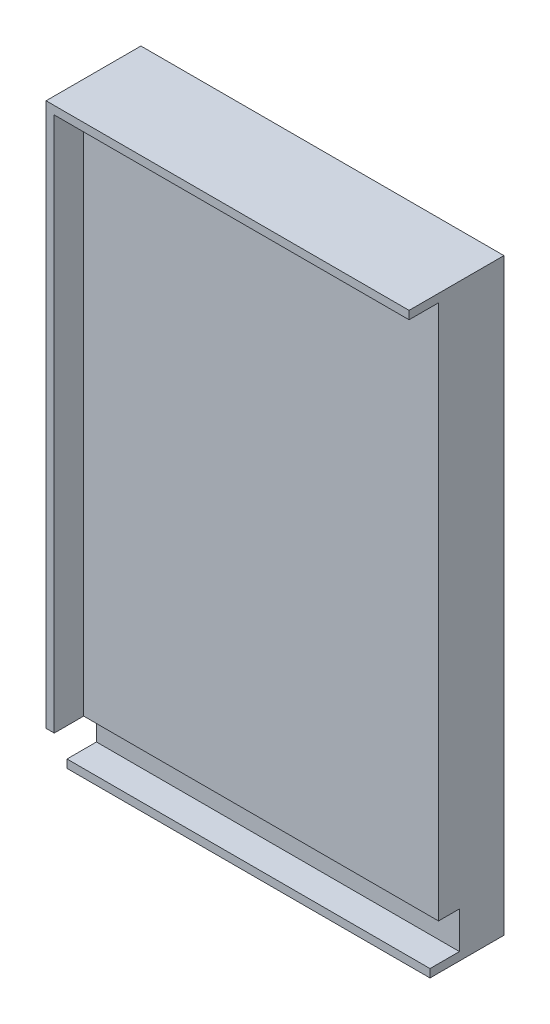
ISO-10303-21;
HEADER;
FILE_DESCRIPTION(('STEP AP214'),'2;1');
FILE_NAME('part.step','',(''),(''),'','','');
FILE_SCHEMA(('AUTOMOTIVE_DESIGN { 1 0 10303 214 1 1 1 1 }'));
ENDSEC;
DATA;
#1=APPLICATION_CONTEXT('core data for automotive mechanical design processes');
#2=APPLICATION_PROTOCOL_DEFINITION('international standard','automotive_design',2000,#1);
#3=PRODUCT_CONTEXT('',#1,'mechanical');
#4=PRODUCT('Part','Part','',(#3));
#5=PRODUCT_RELATED_PRODUCT_CATEGORY('part','',(#4));
#6=PRODUCT_DEFINITION_FORMATION('','',#4);
#7=PRODUCT_DEFINITION_CONTEXT('part definition',#1,'design');
#8=PRODUCT_DEFINITION('design','',#6,#7);
#9=PRODUCT_DEFINITION_SHAPE('','',#8);
#10=(LENGTH_UNIT() NAMED_UNIT(*) SI_UNIT(.MILLI.,.METRE.));
#11=(NAMED_UNIT(*) PLANE_ANGLE_UNIT() SI_UNIT($,.RADIAN.));
#12=(NAMED_UNIT(*) SI_UNIT($,.STERADIAN.) SOLID_ANGLE_UNIT());
#13=UNCERTAINTY_MEASURE_WITH_UNIT(LENGTH_MEASURE(1.E-05),#10,'distance_accuracy_value','');
#14=(GEOMETRIC_REPRESENTATION_CONTEXT(3) GLOBAL_UNCERTAINTY_ASSIGNED_CONTEXT((#13)) GLOBAL_UNIT_ASSIGNED_CONTEXT((#10,
#11,#12)) REPRESENTATION_CONTEXT('',''));
#15=CARTESIAN_POINT('',(0.,0.,0.));
#16=DIRECTION('',(0.,0.,1.));
#17=DIRECTION('',(1.,0.,0.));
#18=AXIS2_PLACEMENT_3D('',#15,#16,#17);
#19=CARTESIAN_POINT('',(72.6068292682926,-97.9603658536585,36.84));
#20=DIRECTION('',(-1.,0.,0.));
#21=DIRECTION('',(0.,-1.,0.));
#22=AXIS2_PLACEMENT_3D('',#19,#20,#21);
#23=PLANE('',#22);
#24=DIRECTION('',(0.,-1.,0.));
#25=VECTOR('',#24,1.);
#26=CARTESIAN_POINT('',(72.6068292682926,-94.7853658536585,28.702));
#27=LINE('',#26,#25);
#28=CARTESIAN_POINT('',(72.6068292682926,-94.7853658536585,28.702));
#29=VERTEX_POINT('',#28);
#30=CARTESIAN_POINT('',(72.6068292682926,-97.9603658536585,28.702));
#31=VERTEX_POINT('',#30);
#32=EDGE_CURVE('E42',#29,#31,#27,.T.);
#33=ORIENTED_EDGE('',*,*,#32,.T.);
#34=DIRECTION('',(0.,0.,1.));
#35=VECTOR('',#34,1.);
#36=CARTESIAN_POINT('',(72.6068292682926,-97.9603658536585,0.));
#37=LINE('',#36,#35);
#38=CARTESIAN_POINT('',(72.6068292682926,-97.9603658536585,0.));
#39=VERTEX_POINT('',#38);
#40=EDGE_CURVE('E201',#39,#31,#37,.T.);
#41=ORIENTED_EDGE('',*,*,#40,.F.);
#42=DIRECTION('',(0.,-1.,0.));
#43=VECTOR('',#42,1.);
#44=CARTESIAN_POINT('',(72.6068292682926,0.,0.));
#45=LINE('',#44,#43);
#46=CARTESIAN_POINT('',(72.6068292682926,130.639634146342,0.));
#47=VERTEX_POINT('',#46);
#48=EDGE_CURVE('E196',#47,#39,#45,.T.);
#49=ORIENTED_EDGE('',*,*,#48,.F.);
#50=DIRECTION('',(0.,0.,-1.));
#51=VECTOR('',#50,1.);
#52=CARTESIAN_POINT('',(72.6068292682926,130.639634146342,25.4));
#53=LINE('',#52,#51);
#54=CARTESIAN_POINT('',(72.6068292682926,130.639634146342,36.83));
#55=VERTEX_POINT('',#54);
#56=EDGE_CURVE('E198',#55,#47,#53,.T.);
#57=ORIENTED_EDGE('',*,*,#56,.F.);
#58=DIRECTION('',(0.,-1.,0.));
#59=VECTOR('',#58,1.);
#60=CARTESIAN_POINT('',(72.6068292682926,127.464634146342,36.83));
#61=LINE('',#60,#59);
#62=CARTESIAN_POINT('',(72.6068292682926,127.464634146342,36.83));
#63=VERTEX_POINT('',#62);
#64=EDGE_CURVE('E47',#55,#63,#61,.T.);
#65=ORIENTED_EDGE('',*,*,#64,.T.);
#66=DIRECTION('',(0.,0.,-1.));
#67=VECTOR('',#66,1.);
#68=CARTESIAN_POINT('',(72.6068292682926,127.464634146342,0.));
#69=LINE('',#68,#67);
#70=CARTESIAN_POINT('',(72.6068292682926,127.464634146342,25.4));
#71=VERTEX_POINT('',#70);
#72=EDGE_CURVE('E11',#63,#71,#69,.T.);
#73=ORIENTED_EDGE('',*,*,#72,.T.);
#74=DIRECTION('',(0.,-1.,0.));
#75=VECTOR('',#74,1.);
#76=CARTESIAN_POINT('',(72.6068292682926,0.,25.4));
#77=LINE('',#76,#75);
#78=CARTESIAN_POINT('',(72.6068292682926,-80.4343658536585,25.4));
#79=VERTEX_POINT('',#78);
#80=EDGE_CURVE('E61',#71,#79,#77,.T.);
#81=ORIENTED_EDGE('',*,*,#80,.T.);
#82=DIRECTION('',(0.,0.,1.));
#83=VECTOR('',#82,1.);
#84=CARTESIAN_POINT('',(72.6068292682926,-80.4343658536585,17.272));
#85=LINE('',#84,#83);
#86=CARTESIAN_POINT('',(72.6068292682926,-80.4343658536585,17.272));
#87=VERTEX_POINT('',#86);
#88=EDGE_CURVE('E194',#87,#79,#85,.T.);
#89=ORIENTED_EDGE('',*,*,#88,.F.);
#90=DIRECTION('',(0.,1.,0.));
#91=VECTOR('',#90,1.);
#92=CARTESIAN_POINT('',(72.6068292682926,0.,17.272));
#93=LINE('',#92,#91);
#94=CARTESIAN_POINT('',(72.6068292682926,-94.7853658536585,17.272));
#95=VERTEX_POINT('',#94);
#96=EDGE_CURVE('E200',#95,#87,#93,.T.);
#97=ORIENTED_EDGE('',*,*,#96,.F.);
#98=DIRECTION('',(0.,0.,1.));
#99=VECTOR('',#98,1.);
#100=CARTESIAN_POINT('',(72.6068292682926,-94.7853658536585,0.));
#101=LINE('',#100,#99);
#102=EDGE_CURVE('E205',#95,#29,#101,.T.);
#103=ORIENTED_EDGE('',*,*,#102,.T.);
#104=EDGE_LOOP('',(#33,#41,#49,#57,#65,#73,#81,#89,#97,#103));
#105=FACE_BOUND('',#104,.T.);
#106=ADVANCED_FACE('F39',(#105),#23,.F.);
#107=CARTESIAN_POINT('',(-68.3631707317073,-94.7853658536585,17.272));
#108=DIRECTION('',(-1.,0.,0.));
#109=DIRECTION('',(0.,0.,1.));
#110=AXIS2_PLACEMENT_3D('',#107,#108,#109);
#111=PLANE('',#110);
#112=DIRECTION('',(0.,0.,-1.));
#113=VECTOR('',#112,1.);
#114=CARTESIAN_POINT('',(-68.3631707317073,-97.9603658536585,17.272));
#115=LINE('',#114,#113);
#116=CARTESIAN_POINT('',(-68.3631707317073,-97.9603658536585,28.702));
#117=VERTEX_POINT('',#116);
#118=CARTESIAN_POINT('',(-68.3631707317073,-97.9603658536585,0.));
#119=VERTEX_POINT('',#118);
#120=EDGE_CURVE('E185',#117,#119,#115,.T.);
#121=ORIENTED_EDGE('',*,*,#120,.F.);
#122=DIRECTION('',(0.,-1.,0.));
#123=VECTOR('',#122,1.);
#124=CARTESIAN_POINT('',(-68.3631707317073,-94.7853658536585,28.702));
#125=LINE('',#124,#123);
#126=CARTESIAN_POINT('',(-68.3631707317073,-94.7853658536585,28.702));
#127=VERTEX_POINT('',#126);
#128=EDGE_CURVE('E190',#127,#117,#125,.T.);
#129=ORIENTED_EDGE('',*,*,#128,.F.);
#130=DIRECTION('',(0.,0.,-1.));
#131=VECTOR('',#130,1.);
#132=CARTESIAN_POINT('',(-68.3631707317073,-94.7853658536585,17.272));
#133=LINE('',#132,#131);
#134=CARTESIAN_POINT('',(-68.3631707317073,-94.7853658536585,17.272));
#135=VERTEX_POINT('',#134);
#136=EDGE_CURVE('E187',#127,#135,#133,.T.);
#137=ORIENTED_EDGE('',*,*,#136,.T.);
#138=DIRECTION('',(0.,-1.,0.));
#139=VECTOR('',#138,1.);
#140=CARTESIAN_POINT('',(-68.3631707317073,-97.9603658536585,17.272));
#141=LINE('',#140,#139);
#142=CARTESIAN_POINT('',(-68.3631707317074,-80.4343658536585,17.272));
#143=VERTEX_POINT('',#142);
#144=EDGE_CURVE('E163',#143,#135,#141,.T.);
#145=ORIENTED_EDGE('',*,*,#144,.F.);
#146=DIRECTION('',(0.,0.,1.));
#147=VECTOR('',#146,1.);
#148=CARTESIAN_POINT('',(-68.3631707317074,-80.4343658536585,17.272));
#149=LINE('',#148,#147);
#150=CARTESIAN_POINT('',(-68.3631707317073,-80.4343658536585,36.83));
#151=VERTEX_POINT('',#150);
#152=EDGE_CURVE('E166',#143,#151,#149,.T.);
#153=ORIENTED_EDGE('',*,*,#152,.T.);
#154=DIRECTION('',(0.,1.,0.));
#155=VECTOR('',#154,1.);
#156=CARTESIAN_POINT('',(-68.3631707317074,130.639634146342,36.83));
#157=LINE('',#156,#155);
#158=CARTESIAN_POINT('',(-68.3631707317074,130.639634146342,36.83));
#159=VERTEX_POINT('',#158);
#160=EDGE_CURVE('E130',#151,#159,#157,.T.);
#161=ORIENTED_EDGE('',*,*,#160,.T.);
#162=DIRECTION('',(0.,0.,-1.));
#163=VECTOR('',#162,1.);
#164=CARTESIAN_POINT('',(-68.3631707317074,130.639634146342,25.4));
#165=LINE('',#164,#163);
#166=CARTESIAN_POINT('',(-68.3631707317074,130.639634146342,0.));
#167=VERTEX_POINT('',#166);
#168=EDGE_CURVE('E177',#159,#167,#165,.T.);
#169=ORIENTED_EDGE('',*,*,#168,.T.);
#170=DIRECTION('',(0.,-1.,0.));
#171=VECTOR('',#170,1.);
#172=CARTESIAN_POINT('',(-68.3631707317074,130.639634146342,0.));
#173=LINE('',#172,#171);
#174=EDGE_CURVE('E169',#167,#119,#173,.T.);
#175=ORIENTED_EDGE('',*,*,#174,.T.);
#176=EDGE_LOOP('',(#121,#129,#137,#145,#153,#161,#169,#175));
#177=FACE_BOUND('',#176,.T.);
#178=ADVANCED_FACE('F227',(#177),#111,.T.);
#179=CARTESIAN_POINT('',(-68.3631707317073,-94.7853658536585,28.702));
#180=DIRECTION('',(0.,0.,1.));
#181=DIRECTION('',(1.,0.,0.));
#182=AXIS2_PLACEMENT_3D('',#179,#180,#181);
#183=PLANE('',#182);
#184=ORIENTED_EDGE('',*,*,#32,.F.);
#185=DIRECTION('',(-1.,0.,0.));
#186=VECTOR('',#185,1.);
#187=CARTESIAN_POINT('',(-68.3631707317073,-94.7853658536585,28.702));
#188=LINE('',#187,#186);
#189=EDGE_CURVE('E184',#29,#127,#188,.T.);
#190=ORIENTED_EDGE('',*,*,#189,.T.);
#191=ORIENTED_EDGE('',*,*,#128,.T.);
#192=DIRECTION('',(-1.,0.,0.));
#193=VECTOR('',#192,1.);
#194=CARTESIAN_POINT('',(-68.3631707317073,-97.9603658536585,28.702));
#195=LINE('',#194,#193);
#196=EDGE_CURVE('E180',#31,#117,#195,.T.);
#197=ORIENTED_EDGE('',*,*,#196,.F.);
#198=EDGE_LOOP('',(#184,#190,#191,#197));
#199=FACE_BOUND('',#198,.T.);
#200=ADVANCED_FACE('F216',(#199),#183,.T.);
#201=CARTESIAN_POINT('',(0.,-94.7853658536585,0.));
#202=DIRECTION('',(0.,1.,0.));
#203=DIRECTION('',(0.,0.,1.));
#204=AXIS2_PLACEMENT_3D('',#201,#202,#203);
#205=PLANE('',#204);
#206=ORIENTED_EDGE('',*,*,#102,.F.);
#207=DIRECTION('',(1.,0.,0.));
#208=VECTOR('',#207,1.);
#209=CARTESIAN_POINT('',(213.576829268293,-94.7853658536585,17.272));
#210=LINE('',#209,#208);
#211=EDGE_CURVE('E181',#135,#95,#210,.T.);
#212=ORIENTED_EDGE('',*,*,#211,.F.);
#213=ORIENTED_EDGE('',*,*,#136,.F.);
#214=ORIENTED_EDGE('',*,*,#189,.F.);
#215=EDGE_LOOP('',(#206,#212,#213,#214));
#216=FACE_BOUND('',#215,.T.);
#217=ADVANCED_FACE('F266',(#216),#205,.T.);
#218=CARTESIAN_POINT('',(0.,-97.9603658536585,0.));
#219=DIRECTION('',(0.,1.,0.));
#220=DIRECTION('',(0.,0.,1.));
#221=AXIS2_PLACEMENT_3D('',#218,#219,#220);
#222=PLANE('',#221);
#223=DIRECTION('',(1.,0.,0.));
#224=VECTOR('',#223,1.);
#225=CARTESIAN_POINT('',(-68.3631707317073,-97.9603658536585,0.));
#226=LINE('',#225,#224);
#227=EDGE_CURVE('E172',#119,#39,#226,.T.);
#228=ORIENTED_EDGE('',*,*,#227,.T.);
#229=ORIENTED_EDGE('',*,*,#40,.T.);
#230=ORIENTED_EDGE('',*,*,#196,.T.);
#231=ORIENTED_EDGE('',*,*,#120,.T.);
#232=EDGE_LOOP('',(#228,#229,#230,#231));
#233=FACE_BOUND('',#232,.T.);
#234=ADVANCED_FACE('F220',(#233),#222,.F.);
#235=CARTESIAN_POINT('',(0.,0.,17.272));
#236=DIRECTION('',(0.,0.,-1.));
#237=DIRECTION('',(-1.,0.,0.));
#238=AXIS2_PLACEMENT_3D('',#235,#236,#237);
#239=PLANE('',#238);
#240=ORIENTED_EDGE('',*,*,#211,.T.);
#241=ORIENTED_EDGE('',*,*,#96,.T.);
#242=DIRECTION('',(-1.,0.,0.));
#243=VECTOR('',#242,1.);
#244=CARTESIAN_POINT('',(-68.3631707317074,-80.4343658536585,17.272));
#245=LINE('',#244,#243);
#246=EDGE_CURVE('E161',#87,#143,#245,.T.);
#247=ORIENTED_EDGE('',*,*,#246,.T.);
#248=ORIENTED_EDGE('',*,*,#144,.T.);
#249=EDGE_LOOP('',(#240,#241,#247,#248));
#250=FACE_BOUND('',#249,.T.);
#251=ADVANCED_FACE('F235',(#250),#239,.F.);
#252=CARTESIAN_POINT('',(0.,0.,25.4));
#253=DIRECTION('',(0.,0.,1.));
#254=DIRECTION('',(1.,0.,0.));
#255=AXIS2_PLACEMENT_3D('',#252,#253,#254);
#256=PLANE('',#255);
#257=ORIENTED_EDGE('',*,*,#80,.F.);
#258=DIRECTION('',(-1.,0.,0.));
#259=VECTOR('',#258,1.);
#260=CARTESIAN_POINT('',(-65.1881707317074,127.464634146342,25.4));
#261=LINE('',#260,#259);
#262=CARTESIAN_POINT('',(-65.1881707317074,127.464634146342,25.4));
#263=VERTEX_POINT('',#262);
#264=EDGE_CURVE('E154',#71,#263,#261,.T.);
#265=ORIENTED_EDGE('',*,*,#264,.T.);
#266=DIRECTION('',(0.,-1.,0.));
#267=VECTOR('',#266,1.);
#268=CARTESIAN_POINT('',(-65.1881707317073,-80.4343658536585,25.4));
#269=LINE('',#268,#267);
#270=CARTESIAN_POINT('',(-65.1881707317073,-80.4343658536585,25.4));
#271=VERTEX_POINT('',#270);
#272=EDGE_CURVE('E149',#263,#271,#269,.T.);
#273=ORIENTED_EDGE('',*,*,#272,.T.);
#274=DIRECTION('',(-1.,0.,0.));
#275=VECTOR('',#274,1.);
#276=CARTESIAN_POINT('',(-68.3631707317074,-80.4343658536585,25.4));
#277=LINE('',#276,#275);
#278=EDGE_CURVE('E147',#79,#271,#277,.T.);
#279=ORIENTED_EDGE('',*,*,#278,.F.);
#280=EDGE_LOOP('',(#257,#265,#273,#279));
#281=FACE_BOUND('',#280,.T.);
#282=ADVANCED_FACE('F233',(#281),#256,.T.);
#283=CARTESIAN_POINT('',(-68.3631707317074,130.639634146342,25.4));
#284=DIRECTION('',(0.,-1.,0.));
#285=DIRECTION('',(1.,0.,0.));
#286=AXIS2_PLACEMENT_3D('',#283,#284,#285);
#287=PLANE('',#286);
#288=DIRECTION('',(1.,0.,0.));
#289=VECTOR('',#288,1.);
#290=CARTESIAN_POINT('',(213.576829268293,130.639634146342,36.83));
#291=LINE('',#290,#289);
#292=EDGE_CURVE('E134',#159,#55,#291,.T.);
#293=ORIENTED_EDGE('',*,*,#292,.T.);
#294=ORIENTED_EDGE('',*,*,#56,.T.);
#295=DIRECTION('',(-1.,0.,0.));
#296=VECTOR('',#295,1.);
#297=CARTESIAN_POINT('',(-68.3631707317074,130.639634146342,0.));
#298=LINE('',#297,#296);
#299=EDGE_CURVE('E175',#47,#167,#298,.T.);
#300=ORIENTED_EDGE('',*,*,#299,.T.);
#301=ORIENTED_EDGE('',*,*,#168,.F.);
#302=EDGE_LOOP('',(#293,#294,#300,#301));
#303=FACE_BOUND('',#302,.T.);
#304=ADVANCED_FACE('F229',(#303),#287,.F.);
#305=CARTESIAN_POINT('',(0.,0.,0.));
#306=DIRECTION('',(0.,0.,1.));
#307=DIRECTION('',(1.,0.,0.));
#308=AXIS2_PLACEMENT_3D('',#305,#306,#307);
#309=PLANE('',#308);
#310=ORIENTED_EDGE('',*,*,#299,.F.);
#311=ORIENTED_EDGE('',*,*,#48,.T.);
#312=ORIENTED_EDGE('',*,*,#227,.F.);
#313=ORIENTED_EDGE('',*,*,#174,.F.);
#314=EDGE_LOOP('',(#310,#311,#312,#313));
#315=FACE_BOUND('',#314,.T.);
#316=ADVANCED_FACE('F225',(#315),#309,.F.);
#317=CARTESIAN_POINT('',(-68.3631707317074,-80.4343658536585,17.272));
#318=DIRECTION('',(0.,1.,0.));
#319=DIRECTION('',(0.,0.,1.));
#320=AXIS2_PLACEMENT_3D('',#317,#318,#319);
#321=PLANE('',#320);
#322=ORIENTED_EDGE('',*,*,#246,.F.);
#323=ORIENTED_EDGE('',*,*,#88,.T.);
#324=ORIENTED_EDGE('',*,*,#278,.T.);
#325=DIRECTION('',(0.,0.,1.));
#326=VECTOR('',#325,1.);
#327=CARTESIAN_POINT('',(-65.1881707317073,-80.4343658536585,36.83));
#328=LINE('',#327,#326);
#329=CARTESIAN_POINT('',(-65.1881707317073,-80.4343658536585,36.83));
#330=VERTEX_POINT('',#329);
#331=EDGE_CURVE('E141',#271,#330,#328,.T.);
#332=ORIENTED_EDGE('',*,*,#331,.T.);
#333=DIRECTION('',(-1.,0.,0.));
#334=VECTOR('',#333,1.);
#335=CARTESIAN_POINT('',(-65.1881707317073,-80.4343658536585,36.83));
#336=LINE('',#335,#334);
#337=EDGE_CURVE('E123',#330,#151,#336,.T.);
#338=ORIENTED_EDGE('',*,*,#337,.T.);
#339=ORIENTED_EDGE('',*,*,#152,.F.);
#340=EDGE_LOOP('',(#322,#323,#324,#332,#338,#339));
#341=FACE_BOUND('',#340,.T.);
#342=ADVANCED_FACE('F146',(#341),#321,.F.);
#343=CARTESIAN_POINT('',(213.576829268293,127.464634146342,36.83));
#344=DIRECTION('',(0.,0.,1.));
#345=DIRECTION('',(1.,0.,0.));
#346=AXIS2_PLACEMENT_3D('',#343,#344,#345);
#347=PLANE('',#346);
#348=ORIENTED_EDGE('',*,*,#64,.F.);
#349=ORIENTED_EDGE('',*,*,#292,.F.);
#350=ORIENTED_EDGE('',*,*,#160,.F.);
#351=ORIENTED_EDGE('',*,*,#337,.F.);
#352=DIRECTION('',(0.,1.,0.));
#353=VECTOR('',#352,1.);
#354=CARTESIAN_POINT('',(-65.1881707317074,130.639634146342,36.83));
#355=LINE('',#354,#353);
#356=CARTESIAN_POINT('',(-65.1881707317074,127.464634146342,36.83));
#357=VERTEX_POINT('',#356);
#358=EDGE_CURVE('E127',#330,#357,#355,.T.);
#359=ORIENTED_EDGE('',*,*,#358,.T.);
#360=DIRECTION('',(1.,0.,0.));
#361=VECTOR('',#360,1.);
#362=CARTESIAN_POINT('',(213.576829268293,127.464634146342,36.83));
#363=LINE('',#362,#361);
#364=EDGE_CURVE('E157',#357,#63,#363,.T.);
#365=ORIENTED_EDGE('',*,*,#364,.T.);
#366=EDGE_LOOP('',(#348,#349,#350,#351,#359,#365));
#367=FACE_BOUND('',#366,.T.);
#368=ADVANCED_FACE('F125',(#367),#347,.T.);
#369=CARTESIAN_POINT('',(0.,127.464634146342,0.));
#370=DIRECTION('',(0.,-1.,0.));
#371=DIRECTION('',(1.,0.,0.));
#372=AXIS2_PLACEMENT_3D('',#369,#370,#371);
#373=PLANE('',#372);
#374=ORIENTED_EDGE('',*,*,#72,.F.);
#375=ORIENTED_EDGE('',*,*,#364,.F.);
#376=DIRECTION('',(0.,0.,1.));
#377=VECTOR('',#376,1.);
#378=CARTESIAN_POINT('',(-65.1881707317074,127.464634146342,36.83));
#379=LINE('',#378,#377);
#380=EDGE_CURVE('E143',#263,#357,#379,.T.);
#381=ORIENTED_EDGE('',*,*,#380,.F.);
#382=ORIENTED_EDGE('',*,*,#264,.F.);
#383=EDGE_LOOP('',(#374,#375,#381,#382));
#384=FACE_BOUND('',#383,.T.);
#385=ADVANCED_FACE('F232',(#384),#373,.T.);
#386=CARTESIAN_POINT('',(-65.1881707317074,0.,0.));
#387=DIRECTION('',(1.,0.,0.));
#388=DIRECTION('',(0.,1.,0.));
#389=AXIS2_PLACEMENT_3D('',#386,#387,#388);
#390=PLANE('',#389);
#391=ORIENTED_EDGE('',*,*,#272,.F.);
#392=ORIENTED_EDGE('',*,*,#380,.T.);
#393=ORIENTED_EDGE('',*,*,#358,.F.);
#394=ORIENTED_EDGE('',*,*,#331,.F.);
#395=EDGE_LOOP('',(#391,#392,#393,#394));
#396=FACE_BOUND('',#395,.T.);
#397=ADVANCED_FACE('F140',(#396),#390,.T.);
#398=CLOSED_SHELL('',(#106,#178,#200,#217,#234,#251,#282,#304,#316,#342,#368,#385,#397));
#399=MANIFOLD_SOLID_BREP('B2',#398);
#400=ADVANCED_BREP_SHAPE_REPRESENTATION('',(#18,#399),#14);
#401=SHAPE_DEFINITION_REPRESENTATION(#9,#400);
ENDSEC;
END-ISO-10303-21;
